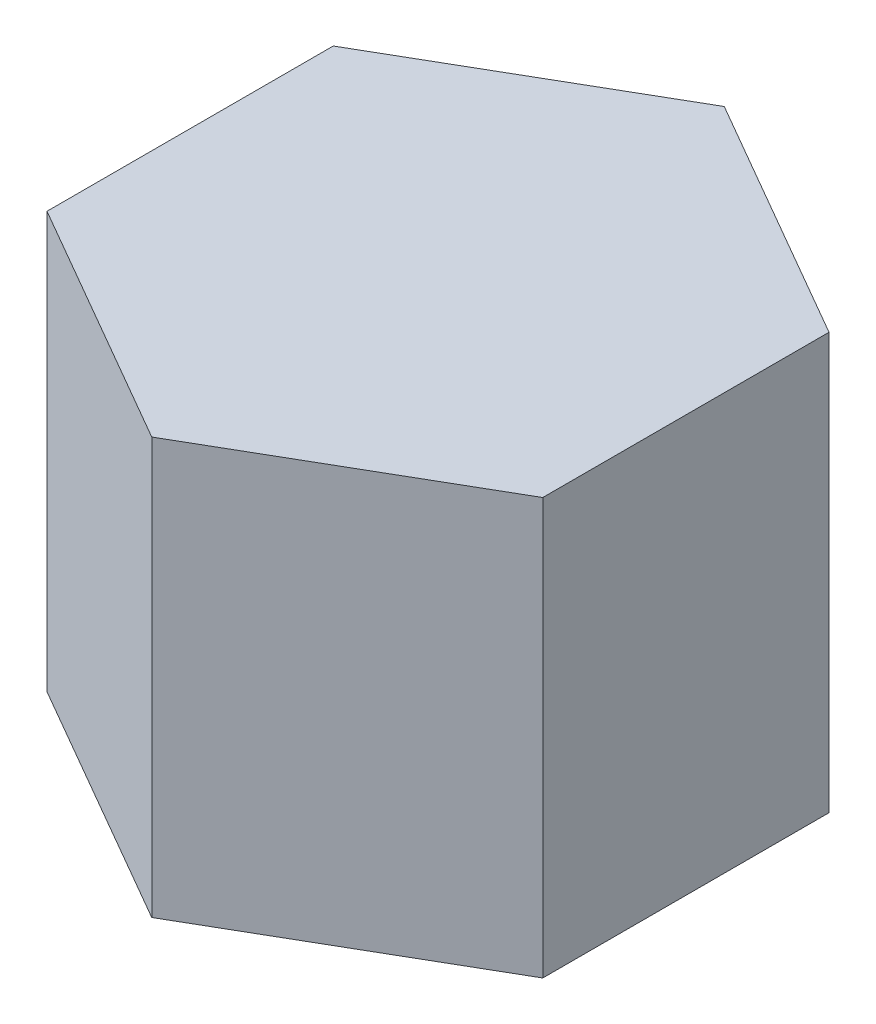
ISO-10303-21;
HEADER;
FILE_DESCRIPTION(('STEP AP214'),'2;1');
FILE_NAME('part.step','',(''),(''),'','','');
FILE_SCHEMA(('AUTOMOTIVE_DESIGN { 1 0 10303 214 1 1 1 1 }'));
ENDSEC;
DATA;
#1=APPLICATION_CONTEXT('core data for automotive mechanical design processes');
#2=APPLICATION_PROTOCOL_DEFINITION('international standard','automotive_design',2000,#1);
#3=PRODUCT_CONTEXT('',#1,'mechanical');
#4=PRODUCT('Part','Part','',(#3));
#5=PRODUCT_RELATED_PRODUCT_CATEGORY('part','',(#4));
#6=PRODUCT_DEFINITION_FORMATION('','',#4);
#7=PRODUCT_DEFINITION_CONTEXT('part definition',#1,'design');
#8=PRODUCT_DEFINITION('design','',#6,#7);
#9=PRODUCT_DEFINITION_SHAPE('','',#8);
#10=(LENGTH_UNIT() NAMED_UNIT(*) SI_UNIT(.MILLI.,.METRE.));
#11=(NAMED_UNIT(*) PLANE_ANGLE_UNIT() SI_UNIT($,.RADIAN.));
#12=(NAMED_UNIT(*) SI_UNIT($,.STERADIAN.) SOLID_ANGLE_UNIT());
#13=UNCERTAINTY_MEASURE_WITH_UNIT(LENGTH_MEASURE(1.E-05),#10,'distance_accuracy_value','');
#14=(GEOMETRIC_REPRESENTATION_CONTEXT(3) GLOBAL_UNCERTAINTY_ASSIGNED_CONTEXT((#13)) GLOBAL_UNIT_ASSIGNED_CONTEXT((#10,
#11,#12)) REPRESENTATION_CONTEXT('',''));
#15=CARTESIAN_POINT('',(0.,0.,0.));
#16=DIRECTION('',(0.,0.,1.));
#17=DIRECTION('',(1.,0.,0.));
#18=AXIS2_PLACEMENT_3D('',#15,#16,#17);
#19=CARTESIAN_POINT('',(206.839551417381,-147.556598747966,296.012098239417));
#20=DIRECTION('',(-0.500000000000062,0.,-0.866025403784403));
#21=DIRECTION('',(-0.866025403784403,0.,0.500000000000062));
#22=AXIS2_PLACEMENT_3D('',#19,#20,#21);
#23=PLANE('',#22);
#24=CARTESIAN_POINT('',(207.142660308706,-147.047793579175,295.837098239417));
#25=DIRECTION('',(-0.866025403784403,0.,0.500000000000062));
#26=VECTOR('',#25,1.);
#27=LINE('',#24,#26);
#28=CARTESIAN_POINT('',(207.142660308706,-147.047793579175,295.837098239417));
#29=VERTEX_POINT('',#28);
#30=CARTESIAN_POINT('',(206.839551417382,-147.047793579175,296.012098239417));
#31=VERTEX_POINT('',#30);
#32=EDGE_CURVE('E170',#29,#31,#27,.T.);
#33=ORIENTED_EDGE('',*,*,#32,.T.);
#34=CARTESIAN_POINT('',(206.839551417382,-147.556598747966,296.012098239417));
#35=DIRECTION('',(0.,1.,0.));
#36=VECTOR('',#35,1.);
#37=LINE('',#34,#36);
#38=CARTESIAN_POINT('',(206.839551417382,-147.556598747966,296.012098239417));
#39=VERTEX_POINT('',#38);
#40=EDGE_CURVE('E35',#39,#31,#37,.T.);
#41=ORIENTED_EDGE('',*,*,#40,.F.);
#42=CARTESIAN_POINT('',(207.142660308706,-147.556598747966,295.837098239417));
#43=DIRECTION('',(-0.866025403784403,0.,0.500000000000062));
#44=VECTOR('',#43,1.);
#45=LINE('',#42,#44);
#46=CARTESIAN_POINT('',(207.142660308706,-147.556598747966,295.837098239417));
#47=VERTEX_POINT('',#46);
#48=EDGE_CURVE('E159',#47,#39,#45,.T.);
#49=ORIENTED_EDGE('',*,*,#48,.F.);
#50=CARTESIAN_POINT('',(207.142660308706,-147.556598747966,295.837098239417));
#51=DIRECTION('',(0.,1.,0.));
#52=VECTOR('',#51,1.);
#53=LINE('',#50,#52);
#54=EDGE_CURVE('E10',#47,#29,#53,.T.);
#55=ORIENTED_EDGE('',*,*,#54,.T.);
#56=EDGE_LOOP('',(#33,#41,#49,#55));
#57=FACE_BOUND('',#56,.T.);
#58=ADVANCED_FACE('F16',(#57),#23,.F.);
#59=CARTESIAN_POINT('',(207.142660308706,-147.556598747966,291.594471220494));
#60=DIRECTION('',(-1.,0.,0.));
#61=DIRECTION('',(0.,-1.,0.));
#62=AXIS2_PLACEMENT_3D('',#59,#60,#61);
#63=PLANE('',#62);
#64=CARTESIAN_POINT('',(207.142660308706,-147.047793579175,295.487098239417));
#65=DIRECTION('',(0.,0.,1.));
#66=VECTOR('',#65,1.);
#67=LINE('',#64,#66);
#68=CARTESIAN_POINT('',(207.142660308706,-147.047793579175,295.487098239417));
#69=VERTEX_POINT('',#68);
#70=EDGE_CURVE('E167',#69,#29,#67,.T.);
#71=ORIENTED_EDGE('',*,*,#70,.T.);
#72=ORIENTED_EDGE('',*,*,#54,.F.);
#73=CARTESIAN_POINT('',(207.142660308706,-147.556598747966,295.487098239417));
#74=DIRECTION('',(0.,0.,1.));
#75=VECTOR('',#74,1.);
#76=LINE('',#73,#75);
#77=CARTESIAN_POINT('',(207.142660308706,-147.556598747966,295.487098239417));
#78=VERTEX_POINT('',#77);
#79=EDGE_CURVE('E156',#78,#47,#76,.T.);
#80=ORIENTED_EDGE('',*,*,#79,.F.);
#81=CARTESIAN_POINT('',(207.142660308706,-147.556598747966,295.487098239417));
#82=DIRECTION('',(0.,1.,0.));
#83=VECTOR('',#82,1.);
#84=LINE('',#81,#83);
#85=EDGE_CURVE('E27',#78,#69,#84,.T.);
#86=ORIENTED_EDGE('',*,*,#85,.T.);
#87=EDGE_LOOP('',(#71,#72,#80,#86));
#88=FACE_BOUND('',#87,.T.);
#89=ADVANCED_FACE('F189',(#88),#63,.F.);
#90=CARTESIAN_POINT('',(207.142660308706,-147.556598747966,295.487098239417));
#91=DIRECTION('',(-0.499999999999978,0.,0.866025403784452));
#92=DIRECTION('',(0.866025403784452,0.,0.499999999999978));
#93=AXIS2_PLACEMENT_3D('',#90,#91,#92);
#94=PLANE('',#93);
#95=CARTESIAN_POINT('',(206.839551417382,-147.047793579175,295.312098239417));
#96=DIRECTION('',(0.866025403784452,0.,0.499999999999978));
#97=VECTOR('',#96,1.);
#98=LINE('',#95,#97);
#99=CARTESIAN_POINT('',(206.839551417382,-147.047793579175,295.312098239417));
#100=VERTEX_POINT('',#99);
#101=EDGE_CURVE('E163',#100,#69,#98,.T.);
#102=ORIENTED_EDGE('',*,*,#101,.T.);
#103=ORIENTED_EDGE('',*,*,#85,.F.);
#104=CARTESIAN_POINT('',(206.839551417382,-147.556598747966,295.312098239417));
#105=DIRECTION('',(0.866025403784452,0.,0.499999999999978));
#106=VECTOR('',#105,1.);
#107=LINE('',#104,#106);
#108=CARTESIAN_POINT('',(206.839551417382,-147.556598747966,295.312098239417));
#109=VERTEX_POINT('',#108);
#110=EDGE_CURVE('E106',#109,#78,#107,.T.);
#111=ORIENTED_EDGE('',*,*,#110,.F.);
#112=CARTESIAN_POINT('',(206.839551417382,-147.556598747966,295.312098239417));
#113=DIRECTION('',(0.,1.,0.));
#114=VECTOR('',#113,1.);
#115=LINE('',#112,#114);
#116=EDGE_CURVE('E94',#109,#100,#115,.T.);
#117=ORIENTED_EDGE('',*,*,#116,.T.);
#118=EDGE_LOOP('',(#102,#103,#111,#117));
#119=FACE_BOUND('',#118,.T.);
#120=ADVANCED_FACE('F198',(#119),#94,.F.);
#121=CARTESIAN_POINT('',(206.839551417382,-147.556598747966,295.312098239417));
#122=DIRECTION('',(0.500000000000096,0.,0.866025403784383));
#123=DIRECTION('',(0.866025403784383,0.,-0.500000000000096));
#124=AXIS2_PLACEMENT_3D('',#121,#122,#123);
#125=PLANE('',#124);
#126=CARTESIAN_POINT('',(206.536442526057,-147.047793579175,295.487098239417));
#127=DIRECTION('',(0.866025403784383,0.,-0.500000000000096));
#128=VECTOR('',#127,1.);
#129=LINE('',#126,#128);
#130=CARTESIAN_POINT('',(206.536442526057,-147.047793579175,295.487098239417));
#131=VERTEX_POINT('',#130);
#132=EDGE_CURVE('E162',#131,#100,#129,.T.);
#133=ORIENTED_EDGE('',*,*,#132,.T.);
#134=ORIENTED_EDGE('',*,*,#116,.F.);
#135=CARTESIAN_POINT('',(206.536442526057,-147.556598747966,295.487098239417));
#136=DIRECTION('',(0.866025403784383,0.,-0.500000000000096));
#137=VECTOR('',#136,1.);
#138=LINE('',#135,#137);
#139=CARTESIAN_POINT('',(206.536442526057,-147.556598747966,295.487098239417));
#140=VERTEX_POINT('',#139);
#141=EDGE_CURVE('E98',#140,#109,#138,.T.);
#142=ORIENTED_EDGE('',*,*,#141,.F.);
#143=CARTESIAN_POINT('',(206.536442526057,-147.556598747966,295.487098239417));
#144=DIRECTION('',(0.,1.,0.));
#145=VECTOR('',#144,1.);
#146=LINE('',#143,#145);
#147=EDGE_CURVE('E79',#140,#131,#146,.T.);
#148=ORIENTED_EDGE('',*,*,#147,.T.);
#149=EDGE_LOOP('',(#133,#134,#142,#148));
#150=FACE_BOUND('',#149,.T.);
#151=ADVANCED_FACE('F100',(#150),#125,.F.);
#152=CARTESIAN_POINT('',(206.536442526057,-147.556598747966,291.594471220494));
#153=DIRECTION('',(1.,0.,0.));
#154=DIRECTION('',(0.,1.,0.));
#155=AXIS2_PLACEMENT_3D('',#152,#153,#154);
#156=PLANE('',#155);
#157=CARTESIAN_POINT('',(206.536442526057,-147.047793579175,295.837098239417));
#158=DIRECTION('',(0.,0.,-1.));
#159=VECTOR('',#158,1.);
#160=LINE('',#157,#159);
#161=CARTESIAN_POINT('',(206.536442526057,-147.047793579175,295.837098239417));
#162=VERTEX_POINT('',#161);
#163=EDGE_CURVE('E88',#162,#131,#160,.T.);
#164=ORIENTED_EDGE('',*,*,#163,.T.);
#165=ORIENTED_EDGE('',*,*,#147,.F.);
#166=CARTESIAN_POINT('',(206.536442526057,-147.556598747966,295.837098239417));
#167=DIRECTION('',(0.,0.,-1.));
#168=VECTOR('',#167,1.);
#169=LINE('',#166,#168);
#170=CARTESIAN_POINT('',(206.536442526057,-147.556598747966,295.837098239417));
#171=VERTEX_POINT('',#170);
#172=EDGE_CURVE('E84',#171,#140,#169,.T.);
#173=ORIENTED_EDGE('',*,*,#172,.F.);
#174=CARTESIAN_POINT('',(206.536442526057,-147.556598747966,295.837098239417));
#175=DIRECTION('',(0.,1.,0.));
#176=VECTOR('',#175,1.);
#177=LINE('',#174,#176);
#178=EDGE_CURVE('E58',#171,#162,#177,.T.);
#179=ORIENTED_EDGE('',*,*,#178,.T.);
#180=EDGE_LOOP('',(#164,#165,#173,#179));
#181=FACE_BOUND('',#180,.T.);
#182=ADVANCED_FACE('F82',(#181),#156,.F.);
#183=CARTESIAN_POINT('',(206.536442526057,-147.556598747966,295.837098239417));
#184=DIRECTION('',(0.500000000000062,0.,-0.866025403784403));
#185=DIRECTION('',(-0.866025403784403,0.,-0.500000000000062));
#186=AXIS2_PLACEMENT_3D('',#183,#184,#185);
#187=PLANE('',#186);
#188=CARTESIAN_POINT('',(206.839551417382,-147.047793579175,296.012098239417));
#189=DIRECTION('',(-0.866025403784403,0.,-0.500000000000062));
#190=VECTOR('',#189,1.);
#191=LINE('',#188,#190);
#192=EDGE_CURVE('E160',#31,#162,#191,.T.);
#193=ORIENTED_EDGE('',*,*,#192,.T.);
#194=ORIENTED_EDGE('',*,*,#178,.F.);
#195=CARTESIAN_POINT('',(206.839551417382,-147.556598747966,296.012098239417));
#196=DIRECTION('',(-0.866025403784403,0.,-0.500000000000062));
#197=VECTOR('',#196,1.);
#198=LINE('',#195,#197);
#199=EDGE_CURVE('E112',#39,#171,#198,.T.);
#200=ORIENTED_EDGE('',*,*,#199,.F.);
#201=ORIENTED_EDGE('',*,*,#40,.T.);
#202=EDGE_LOOP('',(#193,#194,#200,#201));
#203=FACE_BOUND('',#202,.T.);
#204=ADVANCED_FACE('F131',(#203),#187,.F.);
#205=CARTESIAN_POINT('',(206.491105863044,-147.556598747966,291.594471220494));
#206=DIRECTION('',(0.,1.,0.));
#207=DIRECTION('',(-1.,0.,0.));
#208=AXIS2_PLACEMENT_3D('',#205,#206,#207);
#209=PLANE('',#208);
#210=ORIENTED_EDGE('',*,*,#48,.T.);
#211=ORIENTED_EDGE('',*,*,#199,.T.);
#212=ORIENTED_EDGE('',*,*,#172,.T.);
#213=ORIENTED_EDGE('',*,*,#141,.T.);
#214=ORIENTED_EDGE('',*,*,#110,.T.);
#215=ORIENTED_EDGE('',*,*,#79,.T.);
#216=EDGE_LOOP('',(#210,#211,#212,#213,#214,#215));
#217=FACE_BOUND('',#216,.T.);
#218=ADVANCED_FACE('F111',(#217),#209,.F.);
#219=CARTESIAN_POINT('',(206.491105863044,-147.047793579175,291.594471220494));
#220=DIRECTION('',(0.,1.,0.));
#221=DIRECTION('',(-1.,0.,0.));
#222=AXIS2_PLACEMENT_3D('',#219,#220,#221);
#223=PLANE('',#222);
#224=ORIENTED_EDGE('',*,*,#32,.F.);
#225=ORIENTED_EDGE('',*,*,#70,.F.);
#226=ORIENTED_EDGE('',*,*,#101,.F.);
#227=ORIENTED_EDGE('',*,*,#132,.F.);
#228=ORIENTED_EDGE('',*,*,#163,.F.);
#229=ORIENTED_EDGE('',*,*,#192,.F.);
#230=EDGE_LOOP('',(#224,#225,#226,#227,#228,#229));
#231=FACE_BOUND('',#230,.T.);
#232=ADVANCED_FACE('F130',(#231),#223,.T.);
#233=CLOSED_SHELL('',(#58,#89,#120,#151,#182,#204,#218,#232));
#234=MANIFOLD_SOLID_BREP('B1',#233);
#235=ADVANCED_BREP_SHAPE_REPRESENTATION('',(#18,#234),#14);
#236=SHAPE_DEFINITION_REPRESENTATION(#9,#235);
ENDSEC;
END-ISO-10303-21;
